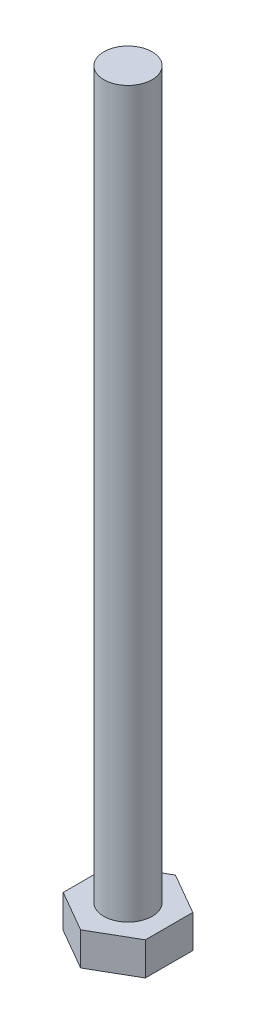
ISO-10303-21;
HEADER;
FILE_DESCRIPTION(('STEP AP214'),'2;1');
FILE_NAME('part.step','',(''),(''),'','','');
FILE_SCHEMA(('AUTOMOTIVE_DESIGN { 1 0 10303 214 1 1 1 1 }'));
ENDSEC;
DATA;
#1=APPLICATION_CONTEXT('core data for automotive mechanical design processes');
#2=APPLICATION_PROTOCOL_DEFINITION('international standard','automotive_design',2000,#1);
#3=PRODUCT_CONTEXT('',#1,'mechanical');
#4=PRODUCT('Part','Part','',(#3));
#5=PRODUCT_RELATED_PRODUCT_CATEGORY('part','',(#4));
#6=PRODUCT_DEFINITION_FORMATION('','',#4);
#7=PRODUCT_DEFINITION_CONTEXT('part definition',#1,'design');
#8=PRODUCT_DEFINITION('design','',#6,#7);
#9=PRODUCT_DEFINITION_SHAPE('','',#8);
#10=(LENGTH_UNIT() NAMED_UNIT(*) SI_UNIT(.MILLI.,.METRE.));
#11=(NAMED_UNIT(*) PLANE_ANGLE_UNIT() SI_UNIT($,.RADIAN.));
#12=(NAMED_UNIT(*) SI_UNIT($,.STERADIAN.) SOLID_ANGLE_UNIT());
#13=UNCERTAINTY_MEASURE_WITH_UNIT(LENGTH_MEASURE(1.E-05),#10,'distance_accuracy_value','');
#14=(GEOMETRIC_REPRESENTATION_CONTEXT(3) GLOBAL_UNCERTAINTY_ASSIGNED_CONTEXT((#13)) GLOBAL_UNIT_ASSIGNED_CONTEXT((#10,
#11,#12)) REPRESENTATION_CONTEXT('',''));
#15=CARTESIAN_POINT('',(0.,0.,0.));
#16=DIRECTION('',(0.,0.,1.));
#17=DIRECTION('',(1.,0.,0.));
#18=AXIS2_PLACEMENT_3D('',#15,#16,#17);
#19=CARTESIAN_POINT('',(0.,8.,0.));
#20=DIRECTION('',(0.,1.,0.));
#21=DIRECTION('',(0.,0.,1.));
#22=AXIS2_PLACEMENT_3D('',#19,#20,#21);
#23=PLANE('',#22);
#24=DIRECTION('',(0.866025403784439,0.,-0.5));
#25=VECTOR('',#24,1.);
#26=CARTESIAN_POINT('',(0.,8.,9.81495457622364));
#27=LINE('',#26,#25);
#28=CARTESIAN_POINT('',(0.,8.,9.81495457622364));
#29=VERTEX_POINT('',#28);
#30=CARTESIAN_POINT('',(8.5,8.,4.90747728811182));
#31=VERTEX_POINT('',#30);
#32=EDGE_CURVE('E119',#29,#31,#27,.T.);
#33=ORIENTED_EDGE('',*,*,#32,.T.);
#34=DIRECTION('',(0.,0.,-1.));
#35=VECTOR('',#34,1.);
#36=CARTESIAN_POINT('',(8.5,8.,4.90747728811182));
#37=LINE('',#36,#35);
#38=CARTESIAN_POINT('',(8.5,8.,-4.90747728811182));
#39=VERTEX_POINT('',#38);
#40=EDGE_CURVE('E108',#31,#39,#37,.T.);
#41=ORIENTED_EDGE('',*,*,#40,.T.);
#42=DIRECTION('',(-0.866025403784439,0.,-0.5));
#43=VECTOR('',#42,1.);
#44=CARTESIAN_POINT('',(8.5,8.,-4.90747728811182));
#45=LINE('',#44,#43);
#46=CARTESIAN_POINT('',(0.,8.,-9.81495457622364));
#47=VERTEX_POINT('',#46);
#48=EDGE_CURVE('E118',#39,#47,#45,.T.);
#49=ORIENTED_EDGE('',*,*,#48,.T.);
#50=DIRECTION('',(-0.866025403784439,0.,0.5));
#51=VECTOR('',#50,1.);
#52=CARTESIAN_POINT('',(0.,8.,-9.81495457622364));
#53=LINE('',#52,#51);
#54=CARTESIAN_POINT('',(-8.5,8.,-4.90747728811182));
#55=VERTEX_POINT('',#54);
#56=EDGE_CURVE('E187',#47,#55,#53,.T.);
#57=ORIENTED_EDGE('',*,*,#56,.T.);
#58=DIRECTION('',(0.,0.,1.));
#59=VECTOR('',#58,1.);
#60=CARTESIAN_POINT('',(-8.5,8.,-4.90747728811182));
#61=LINE('',#60,#59);
#62=CARTESIAN_POINT('',(-8.5,8.,4.90747728811182));
#63=VERTEX_POINT('',#62);
#64=EDGE_CURVE('E189',#55,#63,#61,.T.);
#65=ORIENTED_EDGE('',*,*,#64,.T.);
#66=DIRECTION('',(0.866025403784438,0.,0.5));
#67=VECTOR('',#66,1.);
#68=CARTESIAN_POINT('',(-8.5,8.,4.90747728811182));
#69=LINE('',#68,#67);
#70=EDGE_CURVE('E124',#63,#29,#69,.T.);
#71=ORIENTED_EDGE('',*,*,#70,.T.);
#72=EDGE_LOOP('',(#33,#41,#49,#57,#65,#71));
#73=FACE_BOUND('',#72,.T.);
#74=CARTESIAN_POINT('',(0.,8.,0.));
#75=DIRECTION('',(0.,1.,0.));
#76=DIRECTION('',(0.,0.,1.));
#77=AXIS2_PLACEMENT_3D('',#74,#75,#76);
#78=CIRCLE('',#77,5.);
#79=CARTESIAN_POINT('',(0.,8.,5.));
#80=VERTEX_POINT('',#79);
#81=EDGE_CURVE('E175',#80,#80,#78,.T.);
#82=ORIENTED_EDGE('',*,*,#81,.F.);
#83=EDGE_LOOP('',(#82));
#84=FACE_BOUND('',#83,.T.);
#85=ADVANCED_FACE('F35',(#73,#84),#23,.T.);
#86=CARTESIAN_POINT('',(0.,8.,9.81495457622364));
#87=DIRECTION('',(-0.5,0.,-0.866025403784439));
#88=DIRECTION('',(-0.866025403784439,0.,0.5));
#89=AXIS2_PLACEMENT_3D('',#86,#87,#88);
#90=PLANE('',#89);
#91=DIRECTION('',(0.,-1.,0.));
#92=VECTOR('',#91,1.);
#93=CARTESIAN_POINT('',(0.,8.,9.81495457622364));
#94=LINE('',#93,#92);
#95=CARTESIAN_POINT('',(0.,1.15470053837925,9.81495457622364));
#96=VERTEX_POINT('',#95);
#97=EDGE_CURVE('E192',#29,#96,#94,.T.);
#98=ORIENTED_EDGE('',*,*,#97,.T.);
#99=DIRECTION('',(0.866025403784439,0.,-0.5));
#100=VECTOR('',#99,1.);
#101=CARTESIAN_POINT('',(0.,1.15470053837925,9.81495457622364));
#102=LINE('',#101,#100);
#103=CARTESIAN_POINT('',(8.5,1.15470053837925,4.90747728811182));
#104=VERTEX_POINT('',#103);
#105=EDGE_CURVE('E132',#96,#104,#102,.T.);
#106=ORIENTED_EDGE('',*,*,#105,.T.);
#107=DIRECTION('',(0.,-1.,0.));
#108=VECTOR('',#107,1.);
#109=CARTESIAN_POINT('',(8.5,8.,4.90747728811182));
#110=LINE('',#109,#108);
#111=EDGE_CURVE('E112',#31,#104,#110,.T.);
#112=ORIENTED_EDGE('',*,*,#111,.F.);
#113=ORIENTED_EDGE('',*,*,#32,.F.);
#114=EDGE_LOOP('',(#98,#106,#112,#113));
#115=FACE_BOUND('',#114,.T.);
#116=ADVANCED_FACE('F130',(#115),#90,.F.);
#117=CARTESIAN_POINT('',(8.5,8.,4.90747728811182));
#118=DIRECTION('',(-1.,0.,0.));
#119=DIRECTION('',(0.,0.,1.));
#120=AXIS2_PLACEMENT_3D('',#117,#118,#119);
#121=PLANE('',#120);
#122=ORIENTED_EDGE('',*,*,#111,.T.);
#123=DIRECTION('',(0.,0.,-1.));
#124=VECTOR('',#123,1.);
#125=CARTESIAN_POINT('',(8.5,1.15470053837925,4.90747728811182));
#126=LINE('',#125,#124);
#127=CARTESIAN_POINT('',(8.5,1.15470053837925,-4.90747728811182));
#128=VERTEX_POINT('',#127);
#129=EDGE_CURVE('E154',#104,#128,#126,.T.);
#130=ORIENTED_EDGE('',*,*,#129,.T.);
#131=DIRECTION('',(0.,-1.,0.));
#132=VECTOR('',#131,1.);
#133=CARTESIAN_POINT('',(8.5,8.,-4.90747728811182));
#134=LINE('',#133,#132);
#135=EDGE_CURVE('E115',#39,#128,#134,.T.);
#136=ORIENTED_EDGE('',*,*,#135,.F.);
#137=ORIENTED_EDGE('',*,*,#40,.F.);
#138=EDGE_LOOP('',(#122,#130,#136,#137));
#139=FACE_BOUND('',#138,.T.);
#140=ADVANCED_FACE('F110',(#139),#121,.F.);
#141=CARTESIAN_POINT('',(8.5,8.,-4.90747728811182));
#142=DIRECTION('',(-0.5,0.,0.866025403784439));
#143=DIRECTION('',(0.866025403784439,0.,0.5));
#144=AXIS2_PLACEMENT_3D('',#141,#142,#143);
#145=PLANE('',#144);
#146=ORIENTED_EDGE('',*,*,#135,.T.);
#147=DIRECTION('',(-0.866025403784439,0.,-0.5));
#148=VECTOR('',#147,1.);
#149=CARTESIAN_POINT('',(8.5,1.15470053837925,-4.90747728811182));
#150=LINE('',#149,#148);
#151=CARTESIAN_POINT('',(0.,1.15470053837925,-9.81495457622364));
#152=VERTEX_POINT('',#151);
#153=EDGE_CURVE('E133',#128,#152,#150,.T.);
#154=ORIENTED_EDGE('',*,*,#153,.T.);
#155=DIRECTION('',(0.,-1.,0.));
#156=VECTOR('',#155,1.);
#157=CARTESIAN_POINT('',(0.,8.,-9.81495457622364));
#158=LINE('',#157,#156);
#159=EDGE_CURVE('E138',#47,#152,#158,.T.);
#160=ORIENTED_EDGE('',*,*,#159,.F.);
#161=ORIENTED_EDGE('',*,*,#48,.F.);
#162=EDGE_LOOP('',(#146,#154,#160,#161));
#163=FACE_BOUND('',#162,.T.);
#164=ADVANCED_FACE('F201',(#163),#145,.F.);
#165=CARTESIAN_POINT('',(0.,8.,-9.81495457622364));
#166=DIRECTION('',(0.5,0.,0.866025403784439));
#167=DIRECTION('',(0.866025403784439,0.,-0.5));
#168=AXIS2_PLACEMENT_3D('',#165,#166,#167);
#169=PLANE('',#168);
#170=ORIENTED_EDGE('',*,*,#159,.T.);
#171=DIRECTION('',(-0.866025403784439,0.,0.5));
#172=VECTOR('',#171,1.);
#173=CARTESIAN_POINT('',(0.,1.15470053837925,-9.81495457622364));
#174=LINE('',#173,#172);
#175=CARTESIAN_POINT('',(-8.5,1.15470053837925,-4.90747728811182));
#176=VERTEX_POINT('',#175);
#177=EDGE_CURVE('E11',#152,#176,#174,.T.);
#178=ORIENTED_EDGE('',*,*,#177,.T.);
#179=DIRECTION('',(0.,-1.,0.));
#180=VECTOR('',#179,1.);
#181=CARTESIAN_POINT('',(-8.5,8.,-4.90747728811182));
#182=LINE('',#181,#180);
#183=EDGE_CURVE('E196',#55,#176,#182,.T.);
#184=ORIENTED_EDGE('',*,*,#183,.F.);
#185=ORIENTED_EDGE('',*,*,#56,.F.);
#186=EDGE_LOOP('',(#170,#178,#184,#185));
#187=FACE_BOUND('',#186,.T.);
#188=ADVANCED_FACE('F199',(#187),#169,.F.);
#189=CARTESIAN_POINT('',(-8.5,8.,-4.90747728811182));
#190=DIRECTION('',(1.,0.,0.));
#191=DIRECTION('',(0.,0.,-1.));
#192=AXIS2_PLACEMENT_3D('',#189,#190,#191);
#193=PLANE('',#192);
#194=ORIENTED_EDGE('',*,*,#183,.T.);
#195=DIRECTION('',(0.,0.,1.));
#196=VECTOR('',#195,1.);
#197=CARTESIAN_POINT('',(-8.5,1.15470053837925,-4.90747728811182));
#198=LINE('',#197,#196);
#199=CARTESIAN_POINT('',(-8.5,1.15470053837925,4.90747728811182));
#200=VERTEX_POINT('',#199);
#201=EDGE_CURVE('E44',#176,#200,#198,.T.);
#202=ORIENTED_EDGE('',*,*,#201,.T.);
#203=DIRECTION('',(0.,-1.,0.));
#204=VECTOR('',#203,1.);
#205=CARTESIAN_POINT('',(-8.5,8.,4.90747728811182));
#206=LINE('',#205,#204);
#207=EDGE_CURVE('E194',#63,#200,#206,.T.);
#208=ORIENTED_EDGE('',*,*,#207,.F.);
#209=ORIENTED_EDGE('',*,*,#64,.F.);
#210=EDGE_LOOP('',(#194,#202,#208,#209));
#211=FACE_BOUND('',#210,.T.);
#212=ADVANCED_FACE('F222',(#211),#193,.F.);
#213=CARTESIAN_POINT('',(-8.5,8.,4.90747728811182));
#214=DIRECTION('',(0.5,0.,-0.866025403784438));
#215=DIRECTION('',(-0.866025403784438,0.,-0.5));
#216=AXIS2_PLACEMENT_3D('',#213,#214,#215);
#217=PLANE('',#216);
#218=ORIENTED_EDGE('',*,*,#207,.T.);
#219=DIRECTION('',(0.866025403784438,0.,0.5));
#220=VECTOR('',#219,1.);
#221=CARTESIAN_POINT('',(-8.5,1.15470053837925,4.90747728811182));
#222=LINE('',#221,#220);
#223=EDGE_CURVE('E157',#200,#96,#222,.T.);
#224=ORIENTED_EDGE('',*,*,#223,.T.);
#225=ORIENTED_EDGE('',*,*,#97,.F.);
#226=ORIENTED_EDGE('',*,*,#70,.F.);
#227=EDGE_LOOP('',(#218,#224,#225,#226));
#228=FACE_BOUND('',#227,.T.);
#229=ADVANCED_FACE('F220',(#228),#217,.F.);
#230=CARTESIAN_POINT('',(0.,0.,0.));
#231=DIRECTION('',(0.,1.,0.));
#232=DIRECTION('',(0.,0.,1.));
#233=AXIS2_PLACEMENT_3D('',#230,#231,#232);
#234=PLANE('',#233);
#235=DIRECTION('',(0.866025403784439,0.,-0.5));
#236=VECTOR('',#235,1.);
#237=CARTESIAN_POINT('',(-3.24999999999999,0.,-5.62916512459884));
#238=LINE('',#237,#236);
#239=CARTESIAN_POINT('',(-6.49999999999998,0.,-3.75277674973256));
#240=VERTEX_POINT('',#239);
#241=CARTESIAN_POINT('',(0.,0.,-7.50555349946512));
#242=VERTEX_POINT('',#241);
#243=EDGE_CURVE('E136',#240,#242,#238,.T.);
#244=ORIENTED_EDGE('',*,*,#243,.T.);
#245=DIRECTION('',(0.866025403784439,0.,0.5));
#246=VECTOR('',#245,1.);
#247=CARTESIAN_POINT('',(3.24999999999999,0.,-5.62916512459884));
#248=LINE('',#247,#246);
#249=CARTESIAN_POINT('',(6.49999999999998,0.,-3.75277674973256));
#250=VERTEX_POINT('',#249);
#251=EDGE_CURVE('E151',#242,#250,#248,.T.);
#252=ORIENTED_EDGE('',*,*,#251,.T.);
#253=DIRECTION('',(0.,0.,1.));
#254=VECTOR('',#253,1.);
#255=CARTESIAN_POINT('',(6.49999999999998,0.,0.));
#256=LINE('',#255,#254);
#257=CARTESIAN_POINT('',(6.49999999999998,0.,3.75277674973256));
#258=VERTEX_POINT('',#257);
#259=EDGE_CURVE('E149',#250,#258,#256,.T.);
#260=ORIENTED_EDGE('',*,*,#259,.T.);
#261=DIRECTION('',(-0.866025403784439,0.,0.5));
#262=VECTOR('',#261,1.);
#263=CARTESIAN_POINT('',(3.24999999999999,0.,5.62916512459884));
#264=LINE('',#263,#262);
#265=CARTESIAN_POINT('',(0.,0.,7.50555349946511));
#266=VERTEX_POINT('',#265);
#267=EDGE_CURVE('E147',#258,#266,#264,.T.);
#268=ORIENTED_EDGE('',*,*,#267,.T.);
#269=DIRECTION('',(-0.866025403784439,0.,-0.5));
#270=VECTOR('',#269,1.);
#271=CARTESIAN_POINT('',(-3.24999999999999,0.,5.62916512459883));
#272=LINE('',#271,#270);
#273=CARTESIAN_POINT('',(-6.49999999999998,0.,3.75277674973255));
#274=VERTEX_POINT('',#273);
#275=EDGE_CURVE('E145',#266,#274,#272,.T.);
#276=ORIENTED_EDGE('',*,*,#275,.T.);
#277=DIRECTION('',(0.,0.,-1.));
#278=VECTOR('',#277,1.);
#279=CARTESIAN_POINT('',(-6.49999999999998,0.,0.));
#280=LINE('',#279,#278);
#281=EDGE_CURVE('E143',#274,#240,#280,.T.);
#282=ORIENTED_EDGE('',*,*,#281,.T.);
#283=EDGE_LOOP('',(#244,#252,#260,#268,#276,#282));
#284=FACE_BOUND('',#283,.T.);
#285=ADVANCED_FACE('F215',(#284),#234,.F.);
#286=CARTESIAN_POINT('',(0.,158.,0.));
#287=DIRECTION('',(0.,-1.,0.));
#288=DIRECTION('',(0.,0.,-1.));
#289=AXIS2_PLACEMENT_3D('',#286,#287,#288);
#290=CYLINDRICAL_SURFACE('',#289,5.);
#291=CARTESIAN_POINT('',(0.,158.,0.));
#292=DIRECTION('',(0.,1.,0.));
#293=DIRECTION('',(0.,0.,1.));
#294=AXIS2_PLACEMENT_3D('',#291,#292,#293);
#295=CIRCLE('',#294,5.);
#296=CARTESIAN_POINT('',(0.,158.,5.));
#297=VERTEX_POINT('',#296);
#298=EDGE_CURVE('E128',#297,#297,#295,.T.);
#299=ORIENTED_EDGE('',*,*,#298,.F.);
#300=EDGE_LOOP('',(#299));
#301=FACE_BOUND('',#300,.T.);
#302=ORIENTED_EDGE('',*,*,#81,.T.);
#303=EDGE_LOOP('',(#302));
#304=FACE_BOUND('',#303,.T.);
#305=ADVANCED_FACE('F239',(#301,#304),#290,.T.);
#306=CARTESIAN_POINT('',(0.,158.,0.));
#307=DIRECTION('',(0.,1.,0.));
#308=DIRECTION('',(0.,0.,1.));
#309=AXIS2_PLACEMENT_3D('',#306,#307,#308);
#310=PLANE('',#309);
#311=ORIENTED_EDGE('',*,*,#298,.T.);
#312=EDGE_LOOP('',(#311));
#313=FACE_BOUND('',#312,.T.);
#314=ADVANCED_FACE('F245',(#313),#310,.T.);
#315=CARTESIAN_POINT('',(-8.5,1.15470053837925,4.90747728811182));
#316=DIRECTION('',(0.249999999999998,0.866025403784441,-0.433012701892216));
#317=DIRECTION('',(0.866025403784438,0.,0.5));
#318=AXIS2_PLACEMENT_3D('',#315,#316,#317);
#319=PLANE('',#318);
#320=DIRECTION('',(-0.774596669241485,0.447213595499955,0.447213595499959));
#321=VECTOR('',#320,1.);
#322=CARTESIAN_POINT('',(-5.09999999999999,-0.808290376865466,2.94448637286708));
#323=LINE('',#322,#321);
#324=EDGE_CURVE('E169',#274,#200,#323,.T.);
#325=ORIENTED_EDGE('',*,*,#324,.F.);
#326=ORIENTED_EDGE('',*,*,#275,.F.);
#327=DIRECTION('',(0.,0.447213595499955,0.894427190999918));
#328=VECTOR('',#327,1.);
#329=CARTESIAN_POINT('',(0.,-0.808290376865464,5.88897274573417));
#330=LINE('',#329,#328);
#331=EDGE_CURVE('E39',#96,#266,#330,.F.);
#332=ORIENTED_EDGE('',*,*,#331,.F.);
#333=ORIENTED_EDGE('',*,*,#223,.F.);
#334=EDGE_LOOP('',(#325,#326,#332,#333));
#335=FACE_BOUND('',#334,.T.);
#336=ADVANCED_FACE('F37',(#335),#319,.F.);
#337=CARTESIAN_POINT('',(0.,1.15470053837925,9.81495457622364));
#338=DIRECTION('',(-0.249999999999998,0.866025403784441,-0.433012701892216));
#339=DIRECTION('',(0.866025403784439,0.,-0.5));
#340=AXIS2_PLACEMENT_3D('',#337,#338,#339);
#341=PLANE('',#340);
#342=ORIENTED_EDGE('',*,*,#331,.T.);
#343=ORIENTED_EDGE('',*,*,#267,.F.);
#344=DIRECTION('',(0.774596669241484,0.447213595499955,0.447213595499959));
#345=VECTOR('',#344,1.);
#346=CARTESIAN_POINT('',(5.09999999999999,-0.808290376865463,2.94448637286709));
#347=LINE('',#346,#345);
#348=EDGE_CURVE('E167',#104,#258,#347,.F.);
#349=ORIENTED_EDGE('',*,*,#348,.F.);
#350=ORIENTED_EDGE('',*,*,#105,.F.);
#351=EDGE_LOOP('',(#342,#343,#349,#350));
#352=FACE_BOUND('',#351,.T.);
#353=ADVANCED_FACE('F255',(#352),#341,.F.);
#354=CARTESIAN_POINT('',(-8.5,1.15470053837925,-4.90747728811182));
#355=DIRECTION('',(0.499999999999997,0.86602540378444,0.));
#356=DIRECTION('',(0.,0.,1.));
#357=AXIS2_PLACEMENT_3D('',#354,#355,#356);
#358=PLANE('',#357);
#359=ORIENTED_EDGE('',*,*,#324,.T.);
#360=ORIENTED_EDGE('',*,*,#201,.F.);
#361=DIRECTION('',(-0.774596669241485,0.447213595499955,-0.447213595499959));
#362=VECTOR('',#361,1.);
#363=CARTESIAN_POINT('',(-5.09999999999999,-0.808290376865466,-2.94448637286709));
#364=LINE('',#363,#362);
#365=EDGE_CURVE('E164',#240,#176,#364,.T.);
#366=ORIENTED_EDGE('',*,*,#365,.F.);
#367=ORIENTED_EDGE('',*,*,#281,.F.);
#368=EDGE_LOOP('',(#359,#360,#366,#367));
#369=FACE_BOUND('',#368,.T.);
#370=ADVANCED_FACE('F213',(#369),#358,.F.);
#371=CARTESIAN_POINT('',(8.5,1.15470053837925,4.90747728811182));
#372=DIRECTION('',(-0.499999999999997,0.86602540378444,0.));
#373=DIRECTION('',(0.,0.,-1.));
#374=AXIS2_PLACEMENT_3D('',#371,#372,#373);
#375=PLANE('',#374);
#376=ORIENTED_EDGE('',*,*,#348,.T.);
#377=ORIENTED_EDGE('',*,*,#259,.F.);
#378=DIRECTION('',(0.774596669241485,0.447213595499955,-0.447213595499958));
#379=VECTOR('',#378,1.);
#380=CARTESIAN_POINT('',(5.09999999999998,-0.808290376865466,-2.94448637286709));
#381=LINE('',#380,#379);
#382=EDGE_CURVE('E162',#128,#250,#381,.F.);
#383=ORIENTED_EDGE('',*,*,#382,.F.);
#384=ORIENTED_EDGE('',*,*,#129,.F.);
#385=EDGE_LOOP('',(#376,#377,#383,#384));
#386=FACE_BOUND('',#385,.T.);
#387=ADVANCED_FACE('F262',(#386),#375,.F.);
#388=CARTESIAN_POINT('',(0.,1.15470053837925,-9.81495457622364));
#389=DIRECTION('',(0.249999999999998,0.86602540378444,0.433012701892217));
#390=DIRECTION('',(-0.866025403784439,0.,0.5));
#391=AXIS2_PLACEMENT_3D('',#388,#389,#390);
#392=PLANE('',#391);
#393=ORIENTED_EDGE('',*,*,#365,.T.);
#394=ORIENTED_EDGE('',*,*,#177,.F.);
#395=DIRECTION('',(0.,-0.447213595499955,0.894427190999918));
#396=VECTOR('',#395,1.);
#397=CARTESIAN_POINT('',(0.,1.15470053837925,-9.81495457622364));
#398=LINE('',#397,#396);
#399=EDGE_CURVE('E160',#242,#152,#398,.F.);
#400=ORIENTED_EDGE('',*,*,#399,.F.);
#401=ORIENTED_EDGE('',*,*,#243,.F.);
#402=EDGE_LOOP('',(#393,#394,#400,#401));
#403=FACE_BOUND('',#402,.T.);
#404=ADVANCED_FACE('F211',(#403),#392,.F.);
#405=CARTESIAN_POINT('',(8.5,1.15470053837925,-4.90747728811182));
#406=DIRECTION('',(-0.249999999999999,0.86602540378444,0.433012701892217));
#407=DIRECTION('',(-0.866025403784439,0.,-0.5));
#408=AXIS2_PLACEMENT_3D('',#405,#406,#407);
#409=PLANE('',#408);
#410=ORIENTED_EDGE('',*,*,#382,.T.);
#411=ORIENTED_EDGE('',*,*,#251,.F.);
#412=ORIENTED_EDGE('',*,*,#399,.T.);
#413=ORIENTED_EDGE('',*,*,#153,.F.);
#414=EDGE_LOOP('',(#410,#411,#412,#413));
#415=FACE_BOUND('',#414,.T.);
#416=ADVANCED_FACE('F205',(#415),#409,.F.);
#417=CLOSED_SHELL('',(#85,#116,#140,#164,#188,#212,#229,#285,#305,#314,#336,#353,#370,#387,#404,#416));
#418=MANIFOLD_SOLID_BREP('B2',#417);
#419=ADVANCED_BREP_SHAPE_REPRESENTATION('',(#18,#418),#14);
#420=SHAPE_DEFINITION_REPRESENTATION(#9,#419);
ENDSEC;
END-ISO-10303-21;
